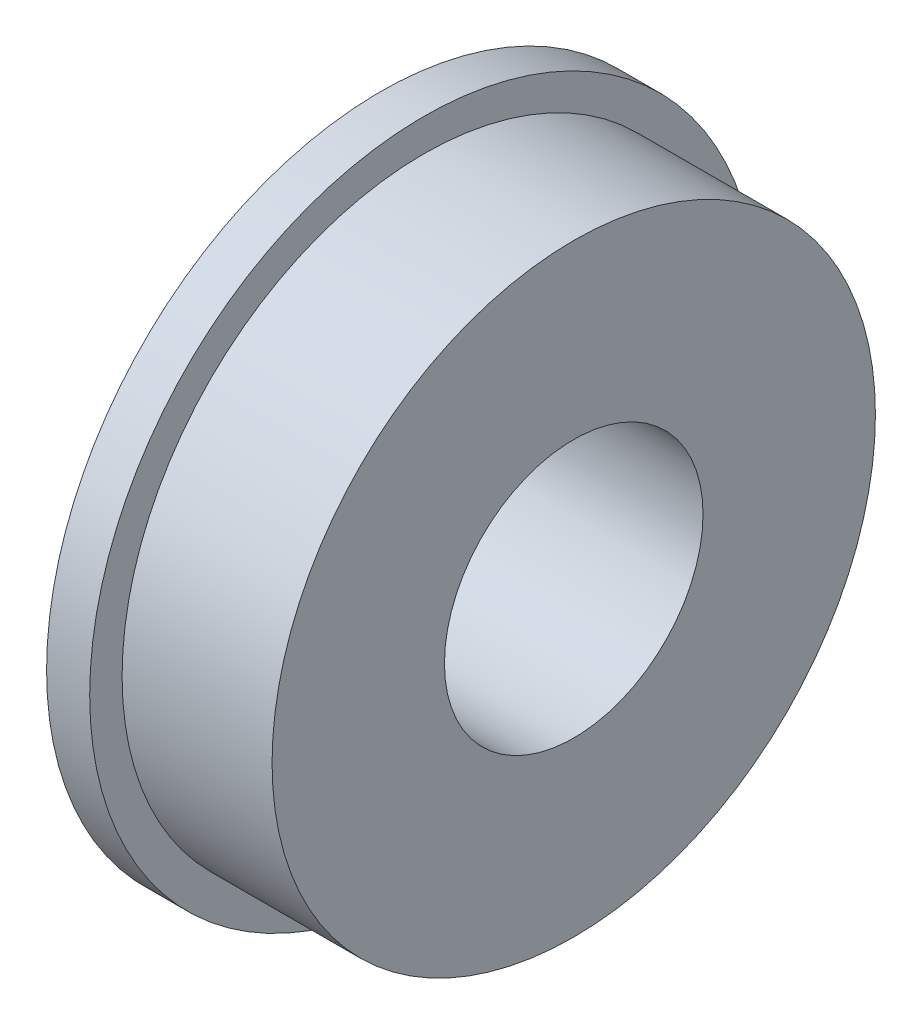
ISO-10303-21;
HEADER;
FILE_DESCRIPTION(('STEP AP214'),'2;1');
FILE_NAME('part.step','',(''),(''),'','','');
FILE_SCHEMA(('AUTOMOTIVE_DESIGN { 1 0 10303 214 1 1 1 1 }'));
ENDSEC;
DATA;
#1=APPLICATION_CONTEXT('core data for automotive mechanical design processes');
#2=APPLICATION_PROTOCOL_DEFINITION('international standard','automotive_design',2000,#1);
#3=PRODUCT_CONTEXT('',#1,'mechanical');
#4=PRODUCT('Part','Part','',(#3));
#5=PRODUCT_RELATED_PRODUCT_CATEGORY('part','',(#4));
#6=PRODUCT_DEFINITION_FORMATION('','',#4);
#7=PRODUCT_DEFINITION_CONTEXT('part definition',#1,'design');
#8=PRODUCT_DEFINITION('design','',#6,#7);
#9=PRODUCT_DEFINITION_SHAPE('','',#8);
#10=(LENGTH_UNIT() NAMED_UNIT(*) SI_UNIT(.MILLI.,.METRE.));
#11=(NAMED_UNIT(*) PLANE_ANGLE_UNIT() SI_UNIT($,.RADIAN.));
#12=(NAMED_UNIT(*) SI_UNIT($,.STERADIAN.) SOLID_ANGLE_UNIT());
#13=UNCERTAINTY_MEASURE_WITH_UNIT(LENGTH_MEASURE(1.E-05),#10,'distance_accuracy_value','');
#14=(GEOMETRIC_REPRESENTATION_CONTEXT(3) GLOBAL_UNCERTAINTY_ASSIGNED_CONTEXT((#13)) GLOBAL_UNIT_ASSIGNED_CONTEXT((#10,
#11,#12)) REPRESENTATION_CONTEXT('',''));
#15=CARTESIAN_POINT('',(0.,0.,0.));
#16=DIRECTION('',(0.,0.,1.));
#17=DIRECTION('',(1.,0.,0.));
#18=AXIS2_PLACEMENT_3D('',#15,#16,#17);
#19=CARTESIAN_POINT('',(0.,0.,0.));
#20=DIRECTION('',(-1.,0.,0.));
#21=DIRECTION('',(0.,0.,1.));
#22=AXIS2_PLACEMENT_3D('',#19,#20,#21);
#23=CYLINDRICAL_SURFACE('',#22,9.906);
#24=CARTESIAN_POINT('',(0.381,0.,0.));
#25=DIRECTION('',(-1.,0.,0.));
#26=DIRECTION('',(0.,0.,1.));
#27=AXIS2_PLACEMENT_3D('',#24,#25,#26);
#28=CIRCLE('',#27,9.906);
#29=CARTESIAN_POINT('',(0.381,0.,9.906));
#30=VERTEX_POINT('',#29);
#31=EDGE_CURVE('E47',#30,#30,#28,.F.);
#32=ORIENTED_EDGE('',*,*,#31,.T.);
#33=EDGE_LOOP('',(#32));
#34=FACE_BOUND('',#33,.T.);
#35=CARTESIAN_POINT('',(0.,0.,0.));
#36=DIRECTION('',(-1.,0.,0.));
#37=DIRECTION('',(0.,0.,1.));
#38=AXIS2_PLACEMENT_3D('',#35,#36,#37);
#39=CIRCLE('',#38,9.906);
#40=CARTESIAN_POINT('',(0.,0.,9.906));
#41=VERTEX_POINT('',#40);
#42=EDGE_CURVE('E19',#41,#41,#39,.T.);
#43=ORIENTED_EDGE('',*,*,#42,.T.);
#44=EDGE_LOOP('',(#43));
#45=FACE_BOUND('',#44,.T.);
#46=ADVANCED_FACE('F16',(#34,#45),#23,.F.);
#47=CARTESIAN_POINT('',(0.,12.3063,0.));
#48=DIRECTION('',(1.,0.,0.));
#49=DIRECTION('',(0.,0.,-1.));
#50=AXIS2_PLACEMENT_3D('',#47,#48,#49);
#51=PLANE('',#50);
#52=CARTESIAN_POINT('',(0.,0.,0.));
#53=DIRECTION('',(-1.,0.,0.));
#54=DIRECTION('',(0.,0.,1.));
#55=AXIS2_PLACEMENT_3D('',#52,#53,#54);
#56=CIRCLE('',#55,12.3063);
#57=CARTESIAN_POINT('',(0.,0.,12.3063));
#58=VERTEX_POINT('',#57);
#59=EDGE_CURVE('E45',#58,#58,#56,.F.);
#60=ORIENTED_EDGE('',*,*,#59,.F.);
#61=EDGE_LOOP('',(#60));
#62=FACE_BOUND('',#61,.T.);
#63=ORIENTED_EDGE('',*,*,#42,.F.);
#64=EDGE_LOOP('',(#63));
#65=FACE_BOUND('',#64,.T.);
#66=ADVANCED_FACE('F55',(#62,#65),#51,.F.);
#67=CARTESIAN_POINT('',(0.381,9.906,0.));
#68=DIRECTION('',(1.,0.,0.));
#69=DIRECTION('',(0.,0.,-1.));
#70=AXIS2_PLACEMENT_3D('',#67,#68,#69);
#71=PLANE('',#70);
#72=ORIENTED_EDGE('',*,*,#31,.F.);
#73=EDGE_LOOP('',(#72));
#74=FACE_BOUND('',#73,.T.);
#75=CARTESIAN_POINT('',(0.381,0.,0.));
#76=DIRECTION('',(-1.,0.,0.));
#77=DIRECTION('',(0.,0.,1.));
#78=AXIS2_PLACEMENT_3D('',#75,#76,#77);
#79=CIRCLE('',#78,6.35);
#80=CARTESIAN_POINT('',(0.381,0.,6.35));
#81=VERTEX_POINT('',#80);
#82=EDGE_CURVE('E42',#81,#81,#79,.T.);
#83=ORIENTED_EDGE('',*,*,#82,.F.);
#84=EDGE_LOOP('',(#83));
#85=FACE_BOUND('',#84,.T.);
#86=ADVANCED_FACE('F57',(#74,#85),#71,.F.);
#87=CARTESIAN_POINT('',(0.,0.,0.));
#88=DIRECTION('',(-1.,0.,0.));
#89=DIRECTION('',(0.,0.,1.));
#90=AXIS2_PLACEMENT_3D('',#87,#88,#89);
#91=CYLINDRICAL_SURFACE('',#90,12.3063);
#92=ORIENTED_EDGE('',*,*,#59,.T.);
#93=EDGE_LOOP('',(#92));
#94=FACE_BOUND('',#93,.T.);
#95=CARTESIAN_POINT('',(1.5875,0.,0.));
#96=DIRECTION('',(-1.,0.,0.));
#97=DIRECTION('',(0.,0.,1.));
#98=AXIS2_PLACEMENT_3D('',#95,#96,#97);
#99=CIRCLE('',#98,12.3063);
#100=CARTESIAN_POINT('',(1.5875,0.,12.3063));
#101=VERTEX_POINT('',#100);
#102=EDGE_CURVE('E39',#101,#101,#99,.T.);
#103=ORIENTED_EDGE('',*,*,#102,.T.);
#104=EDGE_LOOP('',(#103));
#105=FACE_BOUND('',#104,.T.);
#106=ADVANCED_FACE('F64',(#94,#105),#91,.T.);
#107=CARTESIAN_POINT('',(0.,0.,0.));
#108=DIRECTION('',(-1.,0.,0.));
#109=DIRECTION('',(0.,0.,1.));
#110=AXIS2_PLACEMENT_3D('',#107,#108,#109);
#111=CYLINDRICAL_SURFACE('',#110,6.35);
#112=CARTESIAN_POINT('',(0.,0.,0.));
#113=DIRECTION('',(-1.,0.,0.));
#114=DIRECTION('',(0.,0.,1.));
#115=AXIS2_PLACEMENT_3D('',#112,#113,#114);
#116=CIRCLE('',#115,6.35);
#117=CARTESIAN_POINT('',(0.,0.,6.35));
#118=VERTEX_POINT('',#117);
#119=EDGE_CURVE('E36',#118,#118,#116,.F.);
#120=ORIENTED_EDGE('',*,*,#119,.T.);
#121=EDGE_LOOP('',(#120));
#122=FACE_BOUND('',#121,.T.);
#123=ORIENTED_EDGE('',*,*,#82,.T.);
#124=EDGE_LOOP('',(#123));
#125=FACE_BOUND('',#124,.T.);
#126=ADVANCED_FACE('F90',(#122,#125),#111,.T.);
#127=CARTESIAN_POINT('',(1.5875,11.1125,0.));
#128=DIRECTION('',(-1.,0.,0.));
#129=DIRECTION('',(0.,0.,1.));
#130=AXIS2_PLACEMENT_3D('',#127,#128,#129);
#131=PLANE('',#130);
#132=CARTESIAN_POINT('',(1.5875,0.,0.));
#133=DIRECTION('',(-1.,0.,0.));
#134=DIRECTION('',(0.,0.,1.));
#135=AXIS2_PLACEMENT_3D('',#132,#133,#134);
#136=CIRCLE('',#135,11.1125);
#137=CARTESIAN_POINT('',(1.5875,0.,11.1125));
#138=VERTEX_POINT('',#137);
#139=EDGE_CURVE('E33',#138,#138,#136,.F.);
#140=ORIENTED_EDGE('',*,*,#139,.F.);
#141=EDGE_LOOP('',(#140));
#142=FACE_BOUND('',#141,.T.);
#143=ORIENTED_EDGE('',*,*,#102,.F.);
#144=EDGE_LOOP('',(#143));
#145=FACE_BOUND('',#144,.T.);
#146=ADVANCED_FACE('F86',(#142,#145),#131,.F.);
#147=CARTESIAN_POINT('',(0.,6.35,0.));
#148=DIRECTION('',(1.,0.,0.));
#149=DIRECTION('',(0.,0.,-1.));
#150=AXIS2_PLACEMENT_3D('',#147,#148,#149);
#151=PLANE('',#150);
#152=ORIENTED_EDGE('',*,*,#119,.F.);
#153=EDGE_LOOP('',(#152));
#154=FACE_BOUND('',#153,.T.);
#155=CARTESIAN_POINT('',(0.,0.,0.));
#156=DIRECTION('',(-1.,0.,0.));
#157=DIRECTION('',(0.,0.,1.));
#158=AXIS2_PLACEMENT_3D('',#155,#156,#157);
#159=CIRCLE('',#158,4.7625);
#160=CARTESIAN_POINT('',(0.,0.,4.7625));
#161=VERTEX_POINT('',#160);
#162=EDGE_CURVE('E28',#161,#161,#159,.F.);
#163=ORIENTED_EDGE('',*,*,#162,.T.);
#164=EDGE_LOOP('',(#163));
#165=FACE_BOUND('',#164,.T.);
#166=ADVANCED_FACE('F82',(#154,#165),#151,.F.);
#167=CARTESIAN_POINT('',(0.,0.,0.));
#168=DIRECTION('',(-1.,0.,0.));
#169=DIRECTION('',(0.,0.,1.));
#170=AXIS2_PLACEMENT_3D('',#167,#168,#169);
#171=CYLINDRICAL_SURFACE('',#170,11.1125);
#172=ORIENTED_EDGE('',*,*,#139,.T.);
#173=EDGE_LOOP('',(#172));
#174=FACE_BOUND('',#173,.T.);
#175=CARTESIAN_POINT('',(7.112,0.,0.));
#176=DIRECTION('',(-1.,0.,0.));
#177=DIRECTION('',(0.,0.,1.));
#178=AXIS2_PLACEMENT_3D('',#175,#176,#177);
#179=CIRCLE('',#178,11.1125);
#180=CARTESIAN_POINT('',(7.112,0.,11.1125));
#181=VERTEX_POINT('',#180);
#182=EDGE_CURVE('E23',#181,#181,#179,.T.);
#183=ORIENTED_EDGE('',*,*,#182,.T.);
#184=EDGE_LOOP('',(#183));
#185=FACE_BOUND('',#184,.T.);
#186=ADVANCED_FACE('F76',(#174,#185),#171,.T.);
#187=CARTESIAN_POINT('',(0.,0.,0.));
#188=DIRECTION('',(-1.,0.,0.));
#189=DIRECTION('',(0.,0.,1.));
#190=AXIS2_PLACEMENT_3D('',#187,#188,#189);
#191=CYLINDRICAL_SURFACE('',#190,4.7625);
#192=CARTESIAN_POINT('',(7.112,0.,0.));
#193=DIRECTION('',(-1.,0.,0.));
#194=DIRECTION('',(0.,0.,1.));
#195=AXIS2_PLACEMENT_3D('',#192,#193,#194);
#196=CIRCLE('',#195,4.7625);
#197=CARTESIAN_POINT('',(7.112,0.,4.7625));
#198=VERTEX_POINT('',#197);
#199=EDGE_CURVE('E10',#198,#198,#196,.F.);
#200=ORIENTED_EDGE('',*,*,#199,.T.);
#201=EDGE_LOOP('',(#200));
#202=FACE_BOUND('',#201,.T.);
#203=ORIENTED_EDGE('',*,*,#162,.F.);
#204=EDGE_LOOP('',(#203));
#205=FACE_BOUND('',#204,.T.);
#206=ADVANCED_FACE('F70',(#202,#205),#191,.F.);
#207=CARTESIAN_POINT('',(7.112,4.7625,0.));
#208=DIRECTION('',(-1.,0.,0.));
#209=DIRECTION('',(0.,0.,1.));
#210=AXIS2_PLACEMENT_3D('',#207,#208,#209);
#211=PLANE('',#210);
#212=ORIENTED_EDGE('',*,*,#199,.F.);
#213=EDGE_LOOP('',(#212));
#214=FACE_BOUND('',#213,.T.);
#215=ORIENTED_EDGE('',*,*,#182,.F.);
#216=EDGE_LOOP('',(#215));
#217=FACE_BOUND('',#216,.T.);
#218=ADVANCED_FACE('F68',(#214,#217),#211,.F.);
#219=CLOSED_SHELL('',(#46,#66,#86,#106,#126,#146,#166,#186,#206,#218));
#220=MANIFOLD_SOLID_BREP('B1',#219);
#221=ADVANCED_BREP_SHAPE_REPRESENTATION('',(#18,#220),#14);
#222=SHAPE_DEFINITION_REPRESENTATION(#9,#221);
ENDSEC;
END-ISO-10303-21;
